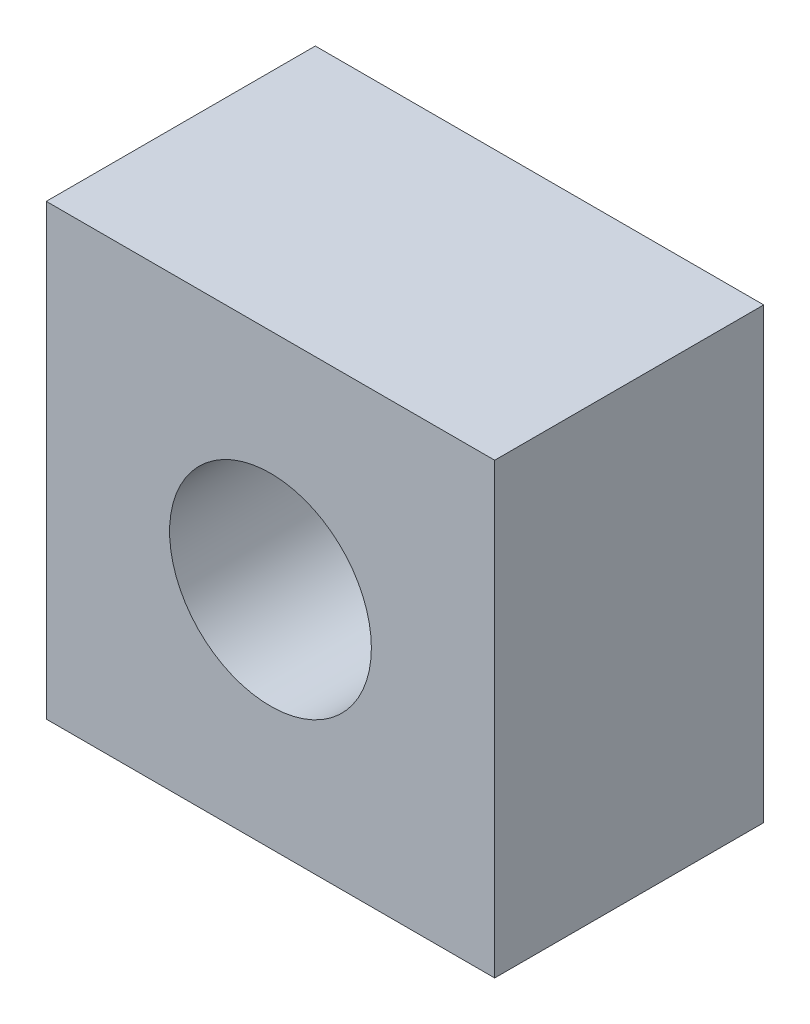
ISO-10303-21;
HEADER;
FILE_DESCRIPTION(('STEP AP214'),'2;1');
FILE_NAME('part.step','',(''),(''),'','','');
FILE_SCHEMA(('AUTOMOTIVE_DESIGN { 1 0 10303 214 1 1 1 1 }'));
ENDSEC;
DATA;
#1=APPLICATION_CONTEXT('core data for automotive mechanical design processes');
#2=APPLICATION_PROTOCOL_DEFINITION('international standard','automotive_design',2000,#1);
#3=PRODUCT_CONTEXT('',#1,'mechanical');
#4=PRODUCT('Part','Part','',(#3));
#5=PRODUCT_RELATED_PRODUCT_CATEGORY('part','',(#4));
#6=PRODUCT_DEFINITION_FORMATION('','',#4);
#7=PRODUCT_DEFINITION_CONTEXT('part definition',#1,'design');
#8=PRODUCT_DEFINITION('design','',#6,#7);
#9=PRODUCT_DEFINITION_SHAPE('','',#8);
#10=(LENGTH_UNIT() NAMED_UNIT(*) SI_UNIT(.MILLI.,.METRE.));
#11=(NAMED_UNIT(*) PLANE_ANGLE_UNIT() SI_UNIT($,.RADIAN.));
#12=(NAMED_UNIT(*) SI_UNIT($,.STERADIAN.) SOLID_ANGLE_UNIT());
#13=UNCERTAINTY_MEASURE_WITH_UNIT(LENGTH_MEASURE(1.E-05),#10,'distance_accuracy_value','');
#14=(GEOMETRIC_REPRESENTATION_CONTEXT(3) GLOBAL_UNCERTAINTY_ASSIGNED_CONTEXT((#13)) GLOBAL_UNIT_ASSIGNED_CONTEXT((#10,
#11,#12)) REPRESENTATION_CONTEXT('',''));
#15=CARTESIAN_POINT('',(0.,0.,0.));
#16=DIRECTION('',(0.,0.,1.));
#17=DIRECTION('',(1.,0.,0.));
#18=AXIS2_PLACEMENT_3D('',#15,#16,#17);
#19=CARTESIAN_POINT('',(0.,0.,10.));
#20=DIRECTION('',(0.,0.,1.));
#21=DIRECTION('',(1.,0.,0.));
#22=AXIS2_PLACEMENT_3D('',#19,#20,#21);
#23=PLANE('',#22);
#24=DIRECTION('',(0.,-1.,0.));
#25=VECTOR('',#24,1.);
#26=CARTESIAN_POINT('',(-10.,10.,10.));
#27=LINE('',#26,#25);
#28=CARTESIAN_POINT('',(-10.,10.,10.));
#29=VERTEX_POINT('',#28);
#30=CARTESIAN_POINT('',(-10.,-10.,10.));
#31=VERTEX_POINT('',#30);
#32=EDGE_CURVE('E131',#29,#31,#27,.T.);
#33=ORIENTED_EDGE('',*,*,#32,.T.);
#34=DIRECTION('',(1.,0.,0.));
#35=VECTOR('',#34,1.);
#36=CARTESIAN_POINT('',(-10.,-10.,10.));
#37=LINE('',#36,#35);
#38=CARTESIAN_POINT('',(10.,-10.,10.));
#39=VERTEX_POINT('',#38);
#40=EDGE_CURVE('E105',#31,#39,#37,.T.);
#41=ORIENTED_EDGE('',*,*,#40,.T.);
#42=DIRECTION('',(0.,-1.,0.));
#43=VECTOR('',#42,1.);
#44=CARTESIAN_POINT('',(10.,10.,10.));
#45=LINE('',#44,#43);
#46=CARTESIAN_POINT('',(10.,10.,10.));
#47=VERTEX_POINT('',#46);
#48=EDGE_CURVE('E139',#47,#39,#45,.T.);
#49=ORIENTED_EDGE('',*,*,#48,.F.);
#50=DIRECTION('',(1.,0.,0.));
#51=VECTOR('',#50,1.);
#52=CARTESIAN_POINT('',(-10.,10.,10.));
#53=LINE('',#52,#51);
#54=EDGE_CURVE('E142',#29,#47,#53,.T.);
#55=ORIENTED_EDGE('',*,*,#54,.F.);
#56=EDGE_LOOP('',(#33,#41,#49,#55));
#57=FACE_BOUND('',#56,.T.);
#58=CARTESIAN_POINT('',(0.,0.,10.));
#59=DIRECTION('',(0.,0.,1.));
#60=DIRECTION('',(1.,0.,0.));
#61=AXIS2_PLACEMENT_3D('',#58,#59,#60);
#62=CIRCLE('',#61,4.5);
#63=CARTESIAN_POINT('',(4.5,0.,10.));
#64=VERTEX_POINT('',#63);
#65=EDGE_CURVE('E127',#64,#64,#62,.T.);
#66=ORIENTED_EDGE('',*,*,#65,.F.);
#67=EDGE_LOOP('',(#66));
#68=FACE_BOUND('',#67,.T.);
#69=ADVANCED_FACE('F58',(#57,#68),#23,.T.);
#70=CARTESIAN_POINT('',(-10.,10.,10.));
#71=DIRECTION('',(1.,0.,0.));
#72=DIRECTION('',(0.,1.,0.));
#73=AXIS2_PLACEMENT_3D('',#70,#71,#72);
#74=PLANE('',#73);
#75=DIRECTION('',(0.,0.,-1.));
#76=VECTOR('',#75,1.);
#77=CARTESIAN_POINT('',(-10.,10.,10.));
#78=LINE('',#77,#76);
#79=CARTESIAN_POINT('',(-10.,10.,-2.));
#80=VERTEX_POINT('',#79);
#81=EDGE_CURVE('E74',#29,#80,#78,.T.);
#82=ORIENTED_EDGE('',*,*,#81,.T.);
#83=DIRECTION('',(0.,-1.,0.));
#84=VECTOR('',#83,1.);
#85=CARTESIAN_POINT('',(-10.,10.,-2.));
#86=LINE('',#85,#84);
#87=CARTESIAN_POINT('',(-10.,-10.,-2.));
#88=VERTEX_POINT('',#87);
#89=EDGE_CURVE('E114',#80,#88,#86,.T.);
#90=ORIENTED_EDGE('',*,*,#89,.T.);
#91=DIRECTION('',(0.,0.,-1.));
#92=VECTOR('',#91,1.);
#93=CARTESIAN_POINT('',(-10.,-10.,10.));
#94=LINE('',#93,#92);
#95=EDGE_CURVE('E12',#31,#88,#94,.T.);
#96=ORIENTED_EDGE('',*,*,#95,.F.);
#97=ORIENTED_EDGE('',*,*,#32,.F.);
#98=EDGE_LOOP('',(#82,#90,#96,#97));
#99=FACE_BOUND('',#98,.T.);
#100=ADVANCED_FACE('F60',(#99),#74,.F.);
#101=CARTESIAN_POINT('',(-10.,-10.,10.));
#102=DIRECTION('',(0.,1.,0.));
#103=DIRECTION('',(-1.,0.,0.));
#104=AXIS2_PLACEMENT_3D('',#101,#102,#103);
#105=PLANE('',#104);
#106=ORIENTED_EDGE('',*,*,#95,.T.);
#107=DIRECTION('',(1.,0.,0.));
#108=VECTOR('',#107,1.);
#109=CARTESIAN_POINT('',(-10.,-10.,-2.));
#110=LINE('',#109,#108);
#111=CARTESIAN_POINT('',(10.,-10.,-2.));
#112=VERTEX_POINT('',#111);
#113=EDGE_CURVE('E104',#88,#112,#110,.T.);
#114=ORIENTED_EDGE('',*,*,#113,.T.);
#115=DIRECTION('',(0.,0.,-1.));
#116=VECTOR('',#115,1.);
#117=CARTESIAN_POINT('',(10.,-10.,10.));
#118=LINE('',#117,#116);
#119=EDGE_CURVE('E67',#39,#112,#118,.T.);
#120=ORIENTED_EDGE('',*,*,#119,.F.);
#121=ORIENTED_EDGE('',*,*,#40,.F.);
#122=EDGE_LOOP('',(#106,#114,#120,#121));
#123=FACE_BOUND('',#122,.T.);
#124=ADVANCED_FACE('F102',(#123),#105,.F.);
#125=CARTESIAN_POINT('',(10.,10.,10.));
#126=DIRECTION('',(1.,0.,0.));
#127=DIRECTION('',(0.,1.,0.));
#128=AXIS2_PLACEMENT_3D('',#125,#126,#127);
#129=PLANE('',#128);
#130=ORIENTED_EDGE('',*,*,#119,.T.);
#131=DIRECTION('',(0.,1.,0.));
#132=VECTOR('',#131,1.);
#133=CARTESIAN_POINT('',(10.,10.,-2.));
#134=LINE('',#133,#132);
#135=CARTESIAN_POINT('',(10.,10.,-2.));
#136=VERTEX_POINT('',#135);
#137=EDGE_CURVE('E115',#112,#136,#134,.T.);
#138=ORIENTED_EDGE('',*,*,#137,.T.);
#139=DIRECTION('',(0.,0.,-1.));
#140=VECTOR('',#139,1.);
#141=CARTESIAN_POINT('',(10.,10.,10.));
#142=LINE('',#141,#140);
#143=EDGE_CURVE('E82',#47,#136,#142,.T.);
#144=ORIENTED_EDGE('',*,*,#143,.F.);
#145=ORIENTED_EDGE('',*,*,#48,.T.);
#146=EDGE_LOOP('',(#130,#138,#144,#145));
#147=FACE_BOUND('',#146,.T.);
#148=ADVANCED_FACE('F149',(#147),#129,.T.);
#149=CARTESIAN_POINT('',(-10.,10.,10.));
#150=DIRECTION('',(0.,1.,0.));
#151=DIRECTION('',(0.,0.,1.));
#152=AXIS2_PLACEMENT_3D('',#149,#150,#151);
#153=PLANE('',#152);
#154=ORIENTED_EDGE('',*,*,#143,.T.);
#155=DIRECTION('',(-1.,0.,0.));
#156=VECTOR('',#155,1.);
#157=CARTESIAN_POINT('',(-10.,10.,-2.));
#158=LINE('',#157,#156);
#159=EDGE_CURVE('E123',#136,#80,#158,.T.);
#160=ORIENTED_EDGE('',*,*,#159,.T.);
#161=ORIENTED_EDGE('',*,*,#81,.F.);
#162=ORIENTED_EDGE('',*,*,#54,.T.);
#163=EDGE_LOOP('',(#154,#160,#161,#162));
#164=FACE_BOUND('',#163,.T.);
#165=ADVANCED_FACE('F153',(#164),#153,.T.);
#166=CARTESIAN_POINT('',(0.,0.,10.));
#167=DIRECTION('',(0.,0.,-1.));
#168=DIRECTION('',(-1.,0.,0.));
#169=AXIS2_PLACEMENT_3D('',#166,#167,#168);
#170=CYLINDRICAL_SURFACE('',#169,4.5);
#171=ORIENTED_EDGE('',*,*,#65,.T.);
#172=EDGE_LOOP('',(#171));
#173=FACE_BOUND('',#172,.T.);
#174=CARTESIAN_POINT('',(0.,0.,0.));
#175=DIRECTION('',(0.,0.,1.));
#176=DIRECTION('',(1.,0.,0.));
#177=AXIS2_PLACEMENT_3D('',#174,#175,#176);
#178=CIRCLE('',#177,4.5);
#179=CARTESIAN_POINT('',(4.5,0.,0.));
#180=VERTEX_POINT('',#179);
#181=EDGE_CURVE('E126',#180,#180,#178,.T.);
#182=ORIENTED_EDGE('',*,*,#181,.F.);
#183=EDGE_LOOP('',(#182));
#184=FACE_BOUND('',#183,.T.);
#185=ADVANCED_FACE('F155',(#173,#184),#170,.F.);
#186=CARTESIAN_POINT('',(0.,0.,0.));
#187=DIRECTION('',(0.,0.,1.));
#188=DIRECTION('',(1.,0.,0.));
#189=AXIS2_PLACEMENT_3D('',#186,#187,#188);
#190=PLANE('',#189);
#191=ORIENTED_EDGE('',*,*,#181,.T.);
#192=EDGE_LOOP('',(#191));
#193=FACE_BOUND('',#192,.T.);
#194=ADVANCED_FACE('F161',(#193),#190,.T.);
#195=CARTESIAN_POINT('',(0.,0.,-2.));
#196=DIRECTION('',(0.,0.,1.));
#197=DIRECTION('',(1.,0.,0.));
#198=AXIS2_PLACEMENT_3D('',#195,#196,#197);
#199=PLANE('',#198);
#200=ORIENTED_EDGE('',*,*,#89,.F.);
#201=ORIENTED_EDGE('',*,*,#159,.F.);
#202=ORIENTED_EDGE('',*,*,#137,.F.);
#203=ORIENTED_EDGE('',*,*,#113,.F.);
#204=EDGE_LOOP('',(#200,#201,#202,#203));
#205=FACE_BOUND('',#204,.T.);
#206=ADVANCED_FACE('F112',(#205),#199,.F.);
#207=CLOSED_SHELL('',(#69,#100,#124,#148,#165,#185,#194,#206));
#208=MANIFOLD_SOLID_BREP('B2',#207);
#209=ADVANCED_BREP_SHAPE_REPRESENTATION('',(#18,#208),#14);
#210=SHAPE_DEFINITION_REPRESENTATION(#9,#209);
ENDSEC;
END-ISO-10303-21;
